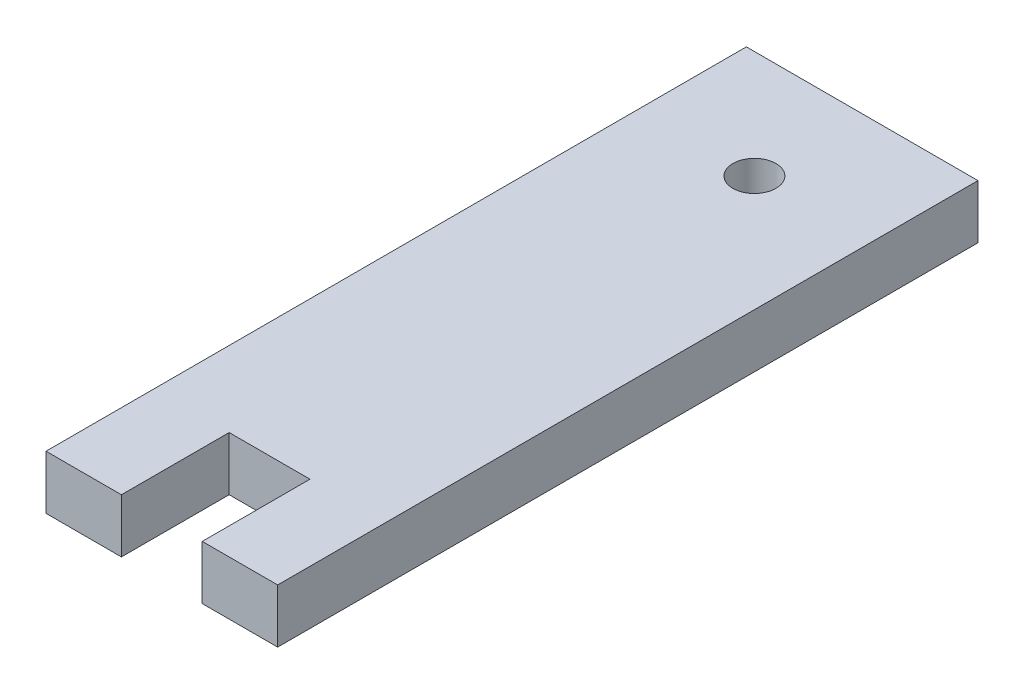
ISO-10303-21;
HEADER;
FILE_DESCRIPTION(('STEP AP214'),'2;1');
FILE_NAME('part.step','',(''),(''),'','','');
FILE_SCHEMA(('AUTOMOTIVE_DESIGN { 1 0 10303 214 1 1 1 1 }'));
ENDSEC;
DATA;
#1=APPLICATION_CONTEXT('core data for automotive mechanical design processes');
#2=APPLICATION_PROTOCOL_DEFINITION('international standard','automotive_design',2000,#1);
#3=PRODUCT_CONTEXT('',#1,'mechanical');
#4=PRODUCT('Part','Part','',(#3));
#5=PRODUCT_RELATED_PRODUCT_CATEGORY('part','',(#4));
#6=PRODUCT_DEFINITION_FORMATION('','',#4);
#7=PRODUCT_DEFINITION_CONTEXT('part definition',#1,'design');
#8=PRODUCT_DEFINITION('design','',#6,#7);
#9=PRODUCT_DEFINITION_SHAPE('','',#8);
#10=(LENGTH_UNIT() NAMED_UNIT(*) SI_UNIT(.MILLI.,.METRE.));
#11=(NAMED_UNIT(*) PLANE_ANGLE_UNIT() SI_UNIT($,.RADIAN.));
#12=(NAMED_UNIT(*) SI_UNIT($,.STERADIAN.) SOLID_ANGLE_UNIT());
#13=UNCERTAINTY_MEASURE_WITH_UNIT(LENGTH_MEASURE(1.E-05),#10,'distance_accuracy_value','');
#14=(GEOMETRIC_REPRESENTATION_CONTEXT(3) GLOBAL_UNCERTAINTY_ASSIGNED_CONTEXT((#13)) GLOBAL_UNIT_ASSIGNED_CONTEXT((#10,
#11,#12)) REPRESENTATION_CONTEXT('',''));
#15=CARTESIAN_POINT('',(0.,0.,0.));
#16=DIRECTION('',(0.,0.,1.));
#17=DIRECTION('',(1.,0.,0.));
#18=AXIS2_PLACEMENT_3D('',#15,#16,#17);
#19=CARTESIAN_POINT('',(0.,5.,0.));
#20=DIRECTION('',(0.,-1.,0.));
#21=DIRECTION('',(0.,0.,-1.));
#22=AXIS2_PLACEMENT_3D('',#19,#20,#21);
#23=PLANE('',#22);
#24=DIRECTION('',(1.,0.,0.));
#25=VECTOR('',#24,1.);
#26=CARTESIAN_POINT('',(3.75,5.,32.5));
#27=LINE('',#26,#25);
#28=CARTESIAN_POINT('',(3.75,5.,32.5));
#29=VERTEX_POINT('',#28);
#30=CARTESIAN_POINT('',(10.75,5.,32.5));
#31=VERTEX_POINT('',#30);
#32=EDGE_CURVE('E164',#29,#31,#27,.T.);
#33=ORIENTED_EDGE('',*,*,#32,.T.);
#34=DIRECTION('',(0.,0.,-1.));
#35=VECTOR('',#34,1.);
#36=CARTESIAN_POINT('',(10.75,5.,-32.5));
#37=LINE('',#36,#35);
#38=CARTESIAN_POINT('',(10.75,5.,-32.5));
#39=VERTEX_POINT('',#38);
#40=EDGE_CURVE('E100',#31,#39,#37,.T.);
#41=ORIENTED_EDGE('',*,*,#40,.T.);
#42=DIRECTION('',(-1.,0.,0.));
#43=VECTOR('',#42,1.);
#44=CARTESIAN_POINT('',(-10.75,5.,-32.5));
#45=LINE('',#44,#43);
#46=CARTESIAN_POINT('',(-10.75,5.,-32.5));
#47=VERTEX_POINT('',#46);
#48=EDGE_CURVE('E185',#39,#47,#45,.T.);
#49=ORIENTED_EDGE('',*,*,#48,.T.);
#50=DIRECTION('',(0.,0.,1.));
#51=VECTOR('',#50,1.);
#52=CARTESIAN_POINT('',(-10.75,5.,-32.5));
#53=LINE('',#52,#51);
#54=CARTESIAN_POINT('',(-10.75,5.,32.5));
#55=VERTEX_POINT('',#54);
#56=EDGE_CURVE('E199',#47,#55,#53,.T.);
#57=ORIENTED_EDGE('',*,*,#56,.T.);
#58=DIRECTION('',(1.,0.,0.));
#59=VECTOR('',#58,1.);
#60=CARTESIAN_POINT('',(-10.75,5.,32.5));
#61=LINE('',#60,#59);
#62=CARTESIAN_POINT('',(-3.75,5.,32.5));
#63=VERTEX_POINT('',#62);
#64=EDGE_CURVE('E119',#55,#63,#61,.T.);
#65=ORIENTED_EDGE('',*,*,#64,.T.);
#66=DIRECTION('',(0.,0.,-1.));
#67=VECTOR('',#66,1.);
#68=CARTESIAN_POINT('',(-3.75,5.,22.5));
#69=LINE('',#68,#67);
#70=CARTESIAN_POINT('',(-3.75,5.,22.5));
#71=VERTEX_POINT('',#70);
#72=EDGE_CURVE('E113',#63,#71,#69,.T.);
#73=ORIENTED_EDGE('',*,*,#72,.T.);
#74=DIRECTION('',(1.,0.,0.));
#75=VECTOR('',#74,1.);
#76=CARTESIAN_POINT('',(-3.75,5.,22.5));
#77=LINE('',#76,#75);
#78=CARTESIAN_POINT('',(3.75,5.,22.5));
#79=VERTEX_POINT('',#78);
#80=EDGE_CURVE('E117',#71,#79,#77,.T.);
#81=ORIENTED_EDGE('',*,*,#80,.T.);
#82=DIRECTION('',(0.,0.,1.));
#83=VECTOR('',#82,1.);
#84=CARTESIAN_POINT('',(3.75,5.,22.5));
#85=LINE('',#84,#83);
#86=EDGE_CURVE('E57',#79,#29,#85,.T.);
#87=ORIENTED_EDGE('',*,*,#86,.T.);
#88=EDGE_LOOP('',(#33,#41,#49,#57,#65,#73,#81,#87));
#89=FACE_BOUND('',#88,.T.);
#90=CARTESIAN_POINT('',(0.,5.,-22.5));
#91=DIRECTION('',(0.,1.,0.));
#92=DIRECTION('',(0.,0.,1.));
#93=AXIS2_PLACEMENT_3D('',#90,#91,#92);
#94=CIRCLE('',#93,2.);
#95=CARTESIAN_POINT('',(0.,5.,-20.5));
#96=VERTEX_POINT('',#95);
#97=EDGE_CURVE('E146',#96,#96,#94,.T.);
#98=ORIENTED_EDGE('',*,*,#97,.F.);
#99=EDGE_LOOP('',(#98));
#100=FACE_BOUND('',#99,.T.);
#101=ADVANCED_FACE('F39',(#89,#100),#23,.F.);
#102=CARTESIAN_POINT('',(0.,0.,0.));
#103=DIRECTION('',(0.,-1.,0.));
#104=DIRECTION('',(0.,0.,-1.));
#105=AXIS2_PLACEMENT_3D('',#102,#103,#104);
#106=PLANE('',#105);
#107=DIRECTION('',(1.,0.,0.));
#108=VECTOR('',#107,1.);
#109=CARTESIAN_POINT('',(3.75,0.,32.5));
#110=LINE('',#109,#108);
#111=CARTESIAN_POINT('',(3.75,0.,32.5));
#112=VERTEX_POINT('',#111);
#113=CARTESIAN_POINT('',(10.75,0.,32.5));
#114=VERTEX_POINT('',#113);
#115=EDGE_CURVE('E141',#112,#114,#110,.T.);
#116=ORIENTED_EDGE('',*,*,#115,.F.);
#117=DIRECTION('',(0.,0.,1.));
#118=VECTOR('',#117,1.);
#119=CARTESIAN_POINT('',(3.75,0.,22.5));
#120=LINE('',#119,#118);
#121=CARTESIAN_POINT('',(3.75,0.,22.5));
#122=VERTEX_POINT('',#121);
#123=EDGE_CURVE('E92',#122,#112,#120,.T.);
#124=ORIENTED_EDGE('',*,*,#123,.F.);
#125=DIRECTION('',(1.,0.,0.));
#126=VECTOR('',#125,1.);
#127=CARTESIAN_POINT('',(-3.75,0.,22.5));
#128=LINE('',#127,#126);
#129=CARTESIAN_POINT('',(-3.75,0.,22.5));
#130=VERTEX_POINT('',#129);
#131=EDGE_CURVE('E86',#130,#122,#128,.T.);
#132=ORIENTED_EDGE('',*,*,#131,.F.);
#133=DIRECTION('',(0.,0.,-1.));
#134=VECTOR('',#133,1.);
#135=CARTESIAN_POINT('',(-3.75,0.,22.5));
#136=LINE('',#135,#134);
#137=CARTESIAN_POINT('',(-3.75,0.,32.5));
#138=VERTEX_POINT('',#137);
#139=EDGE_CURVE('E128',#138,#130,#136,.T.);
#140=ORIENTED_EDGE('',*,*,#139,.F.);
#141=DIRECTION('',(1.,0.,0.));
#142=VECTOR('',#141,1.);
#143=CARTESIAN_POINT('',(-10.75,0.,32.5));
#144=LINE('',#143,#142);
#145=CARTESIAN_POINT('',(-10.75,0.,32.5));
#146=VERTEX_POINT('',#145);
#147=EDGE_CURVE('E155',#146,#138,#144,.T.);
#148=ORIENTED_EDGE('',*,*,#147,.F.);
#149=DIRECTION('',(0.,0.,1.));
#150=VECTOR('',#149,1.);
#151=CARTESIAN_POINT('',(-10.75,0.,-32.5));
#152=LINE('',#151,#150);
#153=CARTESIAN_POINT('',(-10.75,0.,-32.5));
#154=VERTEX_POINT('',#153);
#155=EDGE_CURVE('E152',#154,#146,#152,.T.);
#156=ORIENTED_EDGE('',*,*,#155,.F.);
#157=DIRECTION('',(-1.,0.,0.));
#158=VECTOR('',#157,1.);
#159=CARTESIAN_POINT('',(-10.75,0.,-32.5));
#160=LINE('',#159,#158);
#161=CARTESIAN_POINT('',(10.75,0.,-32.5));
#162=VERTEX_POINT('',#161);
#163=EDGE_CURVE('E149',#162,#154,#160,.T.);
#164=ORIENTED_EDGE('',*,*,#163,.F.);
#165=DIRECTION('',(0.,0.,-1.));
#166=VECTOR('',#165,1.);
#167=CARTESIAN_POINT('',(10.75,0.,-32.5));
#168=LINE('',#167,#166);
#169=EDGE_CURVE('E145',#114,#162,#168,.T.);
#170=ORIENTED_EDGE('',*,*,#169,.F.);
#171=EDGE_LOOP('',(#116,#124,#132,#140,#148,#156,#164,#170));
#172=FACE_BOUND('',#171,.T.);
#173=CARTESIAN_POINT('',(0.,0.,-22.5));
#174=DIRECTION('',(0.,1.,0.));
#175=DIRECTION('',(0.,0.,1.));
#176=AXIS2_PLACEMENT_3D('',#173,#174,#175);
#177=CIRCLE('',#176,2.);
#178=CARTESIAN_POINT('',(0.,0.,-20.5));
#179=VERTEX_POINT('',#178);
#180=EDGE_CURVE('E209',#179,#179,#177,.T.);
#181=ORIENTED_EDGE('',*,*,#180,.T.);
#182=EDGE_LOOP('',(#181));
#183=FACE_BOUND('',#182,.T.);
#184=ADVANCED_FACE('F189',(#172,#183),#106,.T.);
#185=CARTESIAN_POINT('',(3.75,5.,32.5));
#186=DIRECTION('',(0.,0.,-1.));
#187=DIRECTION('',(-1.,0.,0.));
#188=AXIS2_PLACEMENT_3D('',#185,#186,#187);
#189=PLANE('',#188);
#190=ORIENTED_EDGE('',*,*,#115,.T.);
#191=DIRECTION('',(0.,-1.,0.));
#192=VECTOR('',#191,1.);
#193=CARTESIAN_POINT('',(10.75,5.,32.5));
#194=LINE('',#193,#192);
#195=EDGE_CURVE('E11',#31,#114,#194,.T.);
#196=ORIENTED_EDGE('',*,*,#195,.F.);
#197=ORIENTED_EDGE('',*,*,#32,.F.);
#198=DIRECTION('',(0.,-1.,0.));
#199=VECTOR('',#198,1.);
#200=CARTESIAN_POINT('',(3.75,5.,32.5));
#201=LINE('',#200,#199);
#202=EDGE_CURVE('E137',#29,#112,#201,.T.);
#203=ORIENTED_EDGE('',*,*,#202,.T.);
#204=EDGE_LOOP('',(#190,#196,#197,#203));
#205=FACE_BOUND('',#204,.T.);
#206=ADVANCED_FACE('F41',(#205),#189,.F.);
#207=CARTESIAN_POINT('',(10.75,5.,-32.5));
#208=DIRECTION('',(-1.,0.,0.));
#209=DIRECTION('',(0.,0.,1.));
#210=AXIS2_PLACEMENT_3D('',#207,#208,#209);
#211=PLANE('',#210);
#212=ORIENTED_EDGE('',*,*,#169,.T.);
#213=DIRECTION('',(0.,-1.,0.));
#214=VECTOR('',#213,1.);
#215=CARTESIAN_POINT('',(10.75,5.,-32.5));
#216=LINE('',#215,#214);
#217=EDGE_CURVE('E49',#39,#162,#216,.T.);
#218=ORIENTED_EDGE('',*,*,#217,.F.);
#219=ORIENTED_EDGE('',*,*,#40,.F.);
#220=ORIENTED_EDGE('',*,*,#195,.T.);
#221=EDGE_LOOP('',(#212,#218,#219,#220));
#222=FACE_BOUND('',#221,.T.);
#223=ADVANCED_FACE('F239',(#222),#211,.F.);
#224=CARTESIAN_POINT('',(-10.75,5.,-32.5));
#225=DIRECTION('',(0.,0.,1.));
#226=DIRECTION('',(1.,0.,0.));
#227=AXIS2_PLACEMENT_3D('',#224,#225,#226);
#228=PLANE('',#227);
#229=ORIENTED_EDGE('',*,*,#163,.T.);
#230=DIRECTION('',(0.,-1.,0.));
#231=VECTOR('',#230,1.);
#232=CARTESIAN_POINT('',(-10.75,5.,-32.5));
#233=LINE('',#232,#231);
#234=EDGE_CURVE('E175',#47,#154,#233,.T.);
#235=ORIENTED_EDGE('',*,*,#234,.F.);
#236=ORIENTED_EDGE('',*,*,#48,.F.);
#237=ORIENTED_EDGE('',*,*,#217,.T.);
#238=EDGE_LOOP('',(#229,#235,#236,#237));
#239=FACE_BOUND('',#238,.T.);
#240=ADVANCED_FACE('F183',(#239),#228,.F.);
#241=CARTESIAN_POINT('',(-10.75,5.,-32.5));
#242=DIRECTION('',(1.,0.,0.));
#243=DIRECTION('',(0.,0.,-1.));
#244=AXIS2_PLACEMENT_3D('',#241,#242,#243);
#245=PLANE('',#244);
#246=ORIENTED_EDGE('',*,*,#155,.T.);
#247=DIRECTION('',(0.,-1.,0.));
#248=VECTOR('',#247,1.);
#249=CARTESIAN_POINT('',(-10.75,5.,32.5));
#250=LINE('',#249,#248);
#251=EDGE_CURVE('E171',#55,#146,#250,.T.);
#252=ORIENTED_EDGE('',*,*,#251,.F.);
#253=ORIENTED_EDGE('',*,*,#56,.F.);
#254=ORIENTED_EDGE('',*,*,#234,.T.);
#255=EDGE_LOOP('',(#246,#252,#253,#254));
#256=FACE_BOUND('',#255,.T.);
#257=ADVANCED_FACE('F194',(#256),#245,.F.);
#258=CARTESIAN_POINT('',(-10.75,5.,32.5));
#259=DIRECTION('',(0.,0.,-1.));
#260=DIRECTION('',(-1.,0.,0.));
#261=AXIS2_PLACEMENT_3D('',#258,#259,#260);
#262=PLANE('',#261);
#263=ORIENTED_EDGE('',*,*,#147,.T.);
#264=DIRECTION('',(0.,-1.,0.));
#265=VECTOR('',#264,1.);
#266=CARTESIAN_POINT('',(-3.75,5.,32.5));
#267=LINE('',#266,#265);
#268=EDGE_CURVE('E130',#63,#138,#267,.T.);
#269=ORIENTED_EDGE('',*,*,#268,.F.);
#270=ORIENTED_EDGE('',*,*,#64,.F.);
#271=ORIENTED_EDGE('',*,*,#251,.T.);
#272=EDGE_LOOP('',(#263,#269,#270,#271));
#273=FACE_BOUND('',#272,.T.);
#274=ADVANCED_FACE('F197',(#273),#262,.F.);
#275=CARTESIAN_POINT('',(-3.75,5.,22.5));
#276=DIRECTION('',(-1.,0.,0.));
#277=DIRECTION('',(0.,0.,1.));
#278=AXIS2_PLACEMENT_3D('',#275,#276,#277);
#279=PLANE('',#278);
#280=ORIENTED_EDGE('',*,*,#139,.T.);
#281=DIRECTION('',(0.,-1.,0.));
#282=VECTOR('',#281,1.);
#283=CARTESIAN_POINT('',(-3.75,5.,22.5));
#284=LINE('',#283,#282);
#285=EDGE_CURVE('E125',#71,#130,#284,.T.);
#286=ORIENTED_EDGE('',*,*,#285,.F.);
#287=ORIENTED_EDGE('',*,*,#72,.F.);
#288=ORIENTED_EDGE('',*,*,#268,.T.);
#289=EDGE_LOOP('',(#280,#286,#287,#288));
#290=FACE_BOUND('',#289,.T.);
#291=ADVANCED_FACE('F126',(#290),#279,.F.);
#292=CARTESIAN_POINT('',(-3.75,5.,22.5));
#293=DIRECTION('',(0.,0.,-1.));
#294=DIRECTION('',(-1.,0.,0.));
#295=AXIS2_PLACEMENT_3D('',#292,#293,#294);
#296=PLANE('',#295);
#297=ORIENTED_EDGE('',*,*,#131,.T.);
#298=DIRECTION('',(0.,-1.,0.));
#299=VECTOR('',#298,1.);
#300=CARTESIAN_POINT('',(3.75,5.,22.5));
#301=LINE('',#300,#299);
#302=EDGE_CURVE('E131',#79,#122,#301,.T.);
#303=ORIENTED_EDGE('',*,*,#302,.F.);
#304=ORIENTED_EDGE('',*,*,#80,.F.);
#305=ORIENTED_EDGE('',*,*,#285,.T.);
#306=EDGE_LOOP('',(#297,#303,#304,#305));
#307=FACE_BOUND('',#306,.T.);
#308=ADVANCED_FACE('F133',(#307),#296,.F.);
#309=CARTESIAN_POINT('',(3.75,5.,22.5));
#310=DIRECTION('',(1.,0.,0.));
#311=DIRECTION('',(0.,0.,-1.));
#312=AXIS2_PLACEMENT_3D('',#309,#310,#311);
#313=PLANE('',#312);
#314=ORIENTED_EDGE('',*,*,#123,.T.);
#315=ORIENTED_EDGE('',*,*,#202,.F.);
#316=ORIENTED_EDGE('',*,*,#86,.F.);
#317=ORIENTED_EDGE('',*,*,#302,.T.);
#318=EDGE_LOOP('',(#314,#315,#316,#317));
#319=FACE_BOUND('',#318,.T.);
#320=ADVANCED_FACE('F227',(#319),#313,.F.);
#321=CARTESIAN_POINT('',(0.,5.,-22.5));
#322=DIRECTION('',(0.,-1.,0.));
#323=DIRECTION('',(0.,0.,-1.));
#324=AXIS2_PLACEMENT_3D('',#321,#322,#323);
#325=CYLINDRICAL_SURFACE('',#324,2.);
#326=ORIENTED_EDGE('',*,*,#97,.T.);
#327=EDGE_LOOP('',(#326));
#328=FACE_BOUND('',#327,.T.);
#329=ORIENTED_EDGE('',*,*,#180,.F.);
#330=EDGE_LOOP('',(#329));
#331=FACE_BOUND('',#330,.T.);
#332=ADVANCED_FACE('F217',(#328,#331),#325,.F.);
#333=CLOSED_SHELL('',(#101,#184,#206,#223,#240,#257,#274,#291,#308,#320,#332));
#334=MANIFOLD_SOLID_BREP('B2',#333);
#335=ADVANCED_BREP_SHAPE_REPRESENTATION('',(#18,#334),#14);
#336=SHAPE_DEFINITION_REPRESENTATION(#9,#335);
ENDSEC;
END-ISO-10303-21;
